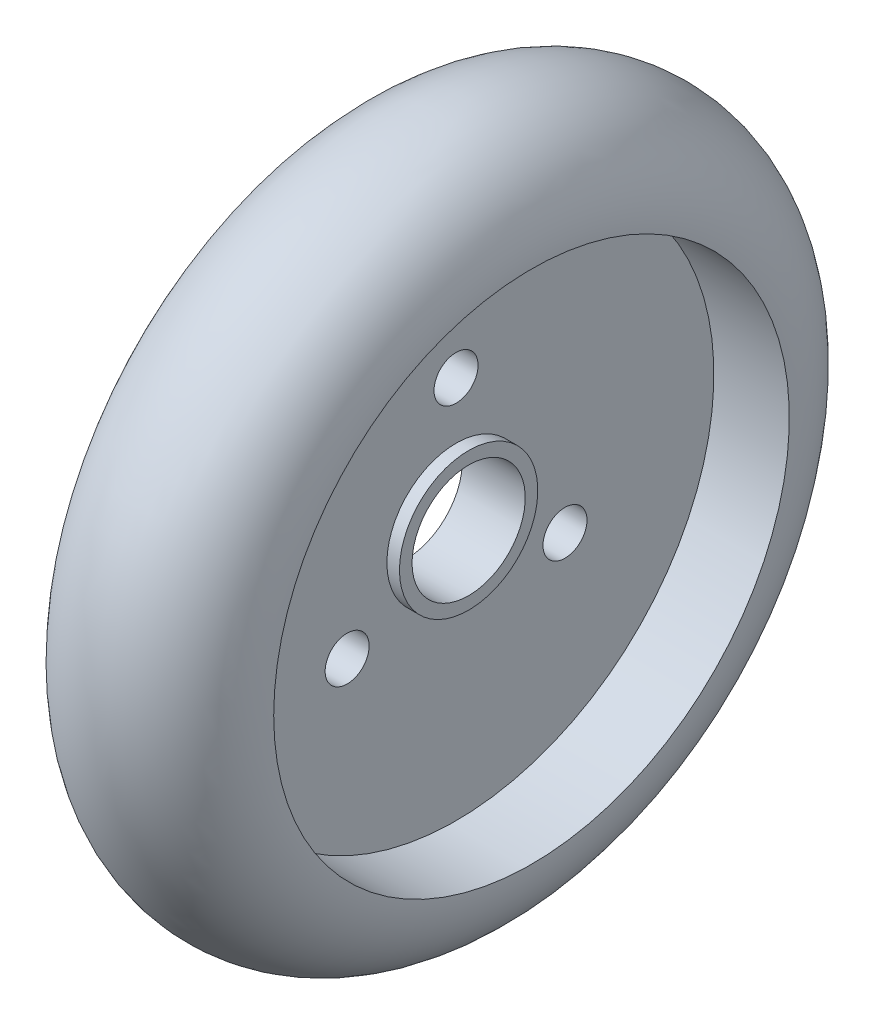
ISO-10303-21;
HEADER;
FILE_DESCRIPTION(('STEP AP214'),'2;1');
FILE_NAME('part.step','',(''),(''),'','','');
FILE_SCHEMA(('AUTOMOTIVE_DESIGN { 1 0 10303 214 1 1 1 1 }'));
ENDSEC;
DATA;
#1=APPLICATION_CONTEXT('core data for automotive mechanical design processes');
#2=APPLICATION_PROTOCOL_DEFINITION('international standard','automotive_design',2000,#1);
#3=PRODUCT_CONTEXT('',#1,'mechanical');
#4=PRODUCT('Part','Part','',(#3));
#5=PRODUCT_RELATED_PRODUCT_CATEGORY('part','',(#4));
#6=PRODUCT_DEFINITION_FORMATION('','',#4);
#7=PRODUCT_DEFINITION_CONTEXT('part definition',#1,'design');
#8=PRODUCT_DEFINITION('design','',#6,#7);
#9=PRODUCT_DEFINITION_SHAPE('','',#8);
#10=(LENGTH_UNIT() NAMED_UNIT(*) SI_UNIT(.MILLI.,.METRE.));
#11=(NAMED_UNIT(*) PLANE_ANGLE_UNIT() SI_UNIT($,.RADIAN.));
#12=(NAMED_UNIT(*) SI_UNIT($,.STERADIAN.) SOLID_ANGLE_UNIT());
#13=UNCERTAINTY_MEASURE_WITH_UNIT(LENGTH_MEASURE(1.E-05),#10,'distance_accuracy_value','');
#14=(GEOMETRIC_REPRESENTATION_CONTEXT(3) GLOBAL_UNCERTAINTY_ASSIGNED_CONTEXT((#13)) GLOBAL_UNIT_ASSIGNED_CONTEXT((#10,
#11,#12)) REPRESENTATION_CONTEXT('',''));
#15=CARTESIAN_POINT('',(0.,0.,0.));
#16=DIRECTION('',(0.,0.,1.));
#17=DIRECTION('',(1.,0.,0.));
#18=AXIS2_PLACEMENT_3D('',#15,#16,#17);
#19=CARTESIAN_POINT('',(2.5,4.5,0.));
#20=DIRECTION('',(-1.,0.,0.));
#21=DIRECTION('',(0.,0.,1.));
#22=AXIS2_PLACEMENT_3D('',#19,#20,#21);
#23=PLANE('',#22);
#24=CARTESIAN_POINT('',(2.5,0.,0.));
#25=DIRECTION('',(-1.,0.,0.));
#26=DIRECTION('',(0.,0.,1.));
#27=AXIS2_PLACEMENT_3D('',#24,#25,#26);
#28=CIRCLE('',#27,5.5);
#29=CARTESIAN_POINT('',(2.5,0.,5.5));
#30=VERTEX_POINT('',#29);
#31=EDGE_CURVE('E10',#30,#30,#28,.T.);
#32=ORIENTED_EDGE('',*,*,#31,.F.);
#33=EDGE_LOOP('',(#32));
#34=FACE_BOUND('',#33,.T.);
#35=CARTESIAN_POINT('',(2.5,0.,0.));
#36=DIRECTION('',(-1.,0.,0.));
#37=DIRECTION('',(0.,0.,1.));
#38=AXIS2_PLACEMENT_3D('',#35,#36,#37);
#39=CIRCLE('',#38,4.5);
#40=CARTESIAN_POINT('',(2.5,0.,4.5));
#41=VERTEX_POINT('',#40);
#42=EDGE_CURVE('E65',#41,#41,#39,.T.);
#43=ORIENTED_EDGE('',*,*,#42,.T.);
#44=EDGE_LOOP('',(#43));
#45=FACE_BOUND('',#44,.T.);
#46=ADVANCED_FACE('F31',(#34,#45),#23,.F.);
#47=CARTESIAN_POINT('',(0.,0.,0.));
#48=DIRECTION('',(-1.,0.,0.));
#49=DIRECTION('',(0.,0.,1.));
#50=AXIS2_PLACEMENT_3D('',#47,#48,#49);
#51=CYLINDRICAL_SURFACE('',#50,5.5);
#52=CARTESIAN_POINT('',(1.5,0.,0.));
#53=DIRECTION('',(-1.,0.,0.));
#54=DIRECTION('',(0.,0.,1.));
#55=AXIS2_PLACEMENT_3D('',#52,#53,#54);
#56=CIRCLE('',#55,5.5);
#57=CARTESIAN_POINT('',(1.5,0.,5.5));
#58=VERTEX_POINT('',#57);
#59=EDGE_CURVE('E38',#58,#58,#56,.T.);
#60=ORIENTED_EDGE('',*,*,#59,.F.);
#61=EDGE_LOOP('',(#60));
#62=FACE_BOUND('',#61,.T.);
#63=ORIENTED_EDGE('',*,*,#31,.T.);
#64=EDGE_LOOP('',(#63));
#65=FACE_BOUND('',#64,.T.);
#66=ADVANCED_FACE('F93',(#62,#65),#51,.T.);
#67=CARTESIAN_POINT('',(1.5,5.5,0.));
#68=DIRECTION('',(-1.,0.,0.));
#69=DIRECTION('',(0.,0.,1.));
#70=AXIS2_PLACEMENT_3D('',#67,#68,#69);
#71=PLANE('',#70);
#72=CARTESIAN_POINT('',(1.5,10.,0.));
#73=DIRECTION('',(-1.,0.,0.));
#74=DIRECTION('',(0.,0.,1.));
#75=AXIS2_PLACEMENT_3D('',#72,#73,#74);
#76=CIRCLE('',#75,1.75);
#77=CARTESIAN_POINT('',(1.5,10.,1.75));
#78=VERTEX_POINT('',#77);
#79=EDGE_CURVE('E62',#78,#78,#76,.T.);
#80=ORIENTED_EDGE('',*,*,#79,.T.);
#81=EDGE_LOOP('',(#80));
#82=FACE_BOUND('',#81,.T.);
#83=CARTESIAN_POINT('',(1.5,-5.,-8.66025403784438));
#84=DIRECTION('',(-1.,0.,0.));
#85=DIRECTION('',(0.,0.,1.));
#86=AXIS2_PLACEMENT_3D('',#83,#84,#85);
#87=CIRCLE('',#86,1.75);
#88=CARTESIAN_POINT('',(1.5,-5.,-6.91025403784438));
#89=VERTEX_POINT('',#88);
#90=EDGE_CURVE('E52',#89,#89,#87,.T.);
#91=ORIENTED_EDGE('',*,*,#90,.T.);
#92=EDGE_LOOP('',(#91));
#93=FACE_BOUND('',#92,.T.);
#94=CARTESIAN_POINT('',(1.5,-5.,8.66025403784439));
#95=DIRECTION('',(-1.,0.,0.));
#96=DIRECTION('',(0.,0.,1.));
#97=AXIS2_PLACEMENT_3D('',#94,#95,#96);
#98=CIRCLE('',#97,1.75);
#99=CARTESIAN_POINT('',(1.5,-5.,10.4102540378444));
#100=VERTEX_POINT('',#99);
#101=EDGE_CURVE('E49',#100,#100,#98,.T.);
#102=ORIENTED_EDGE('',*,*,#101,.T.);
#103=EDGE_LOOP('',(#102));
#104=FACE_BOUND('',#103,.T.);
#105=CARTESIAN_POINT('',(1.5,0.,0.));
#106=DIRECTION('',(-1.,0.,0.));
#107=DIRECTION('',(0.,0.,1.));
#108=AXIS2_PLACEMENT_3D('',#105,#106,#107);
#109=CIRCLE('',#108,20.5);
#110=CARTESIAN_POINT('',(1.5,0.,20.5));
#111=VERTEX_POINT('',#110);
#112=EDGE_CURVE('E43',#111,#111,#109,.T.);
#113=ORIENTED_EDGE('',*,*,#112,.F.);
#114=EDGE_LOOP('',(#113));
#115=FACE_BOUND('',#114,.T.);
#116=ORIENTED_EDGE('',*,*,#59,.T.);
#117=EDGE_LOOP('',(#116));
#118=FACE_BOUND('',#117,.T.);
#119=ADVANCED_FACE('F90',(#82,#93,#104,#115,#118),#71,.F.);
#120=CARTESIAN_POINT('',(0.,0.,0.));
#121=DIRECTION('',(-1.,0.,0.));
#122=DIRECTION('',(0.,0.,1.));
#123=AXIS2_PLACEMENT_3D('',#120,#121,#122);
#124=CYLINDRICAL_SURFACE('',#123,20.5);
#125=CARTESIAN_POINT('',(7.5,0.,0.));
#126=DIRECTION('',(-1.,0.,0.));
#127=DIRECTION('',(0.,0.,1.));
#128=AXIS2_PLACEMENT_3D('',#125,#126,#127);
#129=CIRCLE('',#128,20.5);
#130=CARTESIAN_POINT('',(7.5,0.,20.5));
#131=VERTEX_POINT('',#130);
#132=EDGE_CURVE('E83',#131,#131,#129,.T.);
#133=ORIENTED_EDGE('',*,*,#132,.F.);
#134=EDGE_LOOP('',(#133));
#135=FACE_BOUND('',#134,.T.);
#136=ORIENTED_EDGE('',*,*,#112,.T.);
#137=EDGE_LOOP('',(#136));
#138=FACE_BOUND('',#137,.T.);
#139=ADVANCED_FACE('F88',(#135,#138),#124,.F.);
#140=CARTESIAN_POINT('',(0.,0.,0.));
#141=DIRECTION('',(-1.,0.,0.));
#142=DIRECTION('',(0.,0.,1.));
#143=AXIS2_PLACEMENT_3D('',#140,#141,#142);
#144=TOROIDAL_SURFACE('',#143,20.5,7.5);
#145=CARTESIAN_POINT('',(-7.5,0.,0.));
#146=DIRECTION('',(-1.,0.,0.));
#147=DIRECTION('',(0.,0.,1.));
#148=AXIS2_PLACEMENT_3D('',#145,#146,#147);
#149=CIRCLE('',#148,20.5);
#150=CARTESIAN_POINT('',(-7.5,0.,20.5));
#151=VERTEX_POINT('',#150);
#152=EDGE_CURVE('E80',#151,#151,#149,.T.);
#153=ORIENTED_EDGE('',*,*,#152,.F.);
#154=EDGE_LOOP('',(#153));
#155=FACE_BOUND('',#154,.T.);
#156=ORIENTED_EDGE('',*,*,#132,.T.);
#157=EDGE_LOOP('',(#156));
#158=FACE_BOUND('',#157,.T.);
#159=ADVANCED_FACE('F106',(#155,#158),#144,.T.);
#160=CARTESIAN_POINT('',(0.,0.,0.));
#161=DIRECTION('',(-1.,0.,0.));
#162=DIRECTION('',(0.,0.,1.));
#163=AXIS2_PLACEMENT_3D('',#160,#161,#162);
#164=CYLINDRICAL_SURFACE('',#163,20.5);
#165=CARTESIAN_POINT('',(-1.5,0.,0.));
#166=DIRECTION('',(-1.,0.,0.));
#167=DIRECTION('',(0.,0.,1.));
#168=AXIS2_PLACEMENT_3D('',#165,#166,#167);
#169=CIRCLE('',#168,20.5);
#170=CARTESIAN_POINT('',(-1.5,0.,20.5));
#171=VERTEX_POINT('',#170);
#172=EDGE_CURVE('E77',#171,#171,#169,.T.);
#173=ORIENTED_EDGE('',*,*,#172,.F.);
#174=EDGE_LOOP('',(#173));
#175=FACE_BOUND('',#174,.T.);
#176=ORIENTED_EDGE('',*,*,#152,.T.);
#177=EDGE_LOOP('',(#176));
#178=FACE_BOUND('',#177,.T.);
#179=ADVANCED_FACE('F110',(#175,#178),#164,.F.);
#180=CARTESIAN_POINT('',(-1.5,5.5,0.));
#181=DIRECTION('',(1.,0.,0.));
#182=DIRECTION('',(0.,0.,-1.));
#183=AXIS2_PLACEMENT_3D('',#180,#181,#182);
#184=PLANE('',#183);
#185=CARTESIAN_POINT('',(-1.5,10.,0.));
#186=DIRECTION('',(1.,0.,0.));
#187=DIRECTION('',(0.,0.,-1.));
#188=AXIS2_PLACEMENT_3D('',#185,#186,#187);
#189=CIRCLE('',#188,1.75);
#190=CARTESIAN_POINT('',(-1.5,10.,-1.75));
#191=VERTEX_POINT('',#190);
#192=EDGE_CURVE('E34',#191,#191,#189,.T.);
#193=ORIENTED_EDGE('',*,*,#192,.T.);
#194=EDGE_LOOP('',(#193));
#195=FACE_BOUND('',#194,.T.);
#196=CARTESIAN_POINT('',(-1.5,-5.,-8.66025403784438));
#197=DIRECTION('',(1.,0.,0.));
#198=DIRECTION('',(0.,0.,-1.));
#199=AXIS2_PLACEMENT_3D('',#196,#197,#198);
#200=CIRCLE('',#199,1.75);
#201=CARTESIAN_POINT('',(-1.5,-5.,-10.4102540378444));
#202=VERTEX_POINT('',#201);
#203=EDGE_CURVE('E50',#202,#202,#200,.T.);
#204=ORIENTED_EDGE('',*,*,#203,.T.);
#205=EDGE_LOOP('',(#204));
#206=FACE_BOUND('',#205,.T.);
#207=CARTESIAN_POINT('',(-1.5,-5.,8.66025403784439));
#208=DIRECTION('',(1.,0.,0.));
#209=DIRECTION('',(0.,0.,-1.));
#210=AXIS2_PLACEMENT_3D('',#207,#208,#209);
#211=CIRCLE('',#210,1.75);
#212=CARTESIAN_POINT('',(-1.5,-5.,6.91025403784439));
#213=VERTEX_POINT('',#212);
#214=EDGE_CURVE('E47',#213,#213,#211,.T.);
#215=ORIENTED_EDGE('',*,*,#214,.T.);
#216=EDGE_LOOP('',(#215));
#217=FACE_BOUND('',#216,.T.);
#218=CARTESIAN_POINT('',(-1.5,0.,0.));
#219=DIRECTION('',(-1.,0.,0.));
#220=DIRECTION('',(0.,0.,1.));
#221=AXIS2_PLACEMENT_3D('',#218,#219,#220);
#222=CIRCLE('',#221,5.5);
#223=CARTESIAN_POINT('',(-1.5,0.,5.5));
#224=VERTEX_POINT('',#223);
#225=EDGE_CURVE('E74',#224,#224,#222,.T.);
#226=ORIENTED_EDGE('',*,*,#225,.F.);
#227=EDGE_LOOP('',(#226));
#228=FACE_BOUND('',#227,.T.);
#229=ORIENTED_EDGE('',*,*,#172,.T.);
#230=EDGE_LOOP('',(#229));
#231=FACE_BOUND('',#230,.T.);
#232=ADVANCED_FACE('F114',(#195,#206,#217,#228,#231),#184,.F.);
#233=CARTESIAN_POINT('',(0.,0.,0.));
#234=DIRECTION('',(-1.,0.,0.));
#235=DIRECTION('',(0.,0.,1.));
#236=AXIS2_PLACEMENT_3D('',#233,#234,#235);
#237=CYLINDRICAL_SURFACE('',#236,5.5);
#238=CARTESIAN_POINT('',(-2.5,0.,0.));
#239=DIRECTION('',(-1.,0.,0.));
#240=DIRECTION('',(0.,0.,1.));
#241=AXIS2_PLACEMENT_3D('',#238,#239,#240);
#242=CIRCLE('',#241,5.5);
#243=CARTESIAN_POINT('',(-2.5,0.,5.5));
#244=VERTEX_POINT('',#243);
#245=EDGE_CURVE('E71',#244,#244,#242,.T.);
#246=ORIENTED_EDGE('',*,*,#245,.F.);
#247=EDGE_LOOP('',(#246));
#248=FACE_BOUND('',#247,.T.);
#249=ORIENTED_EDGE('',*,*,#225,.T.);
#250=EDGE_LOOP('',(#249));
#251=FACE_BOUND('',#250,.T.);
#252=ADVANCED_FACE('F118',(#248,#251),#237,.T.);
#253=CARTESIAN_POINT('',(-2.5,4.5,0.));
#254=DIRECTION('',(1.,0.,0.));
#255=DIRECTION('',(0.,0.,-1.));
#256=AXIS2_PLACEMENT_3D('',#253,#254,#255);
#257=PLANE('',#256);
#258=CARTESIAN_POINT('',(-2.5,0.,0.));
#259=DIRECTION('',(-1.,0.,0.));
#260=DIRECTION('',(0.,0.,1.));
#261=AXIS2_PLACEMENT_3D('',#258,#259,#260);
#262=CIRCLE('',#261,4.5);
#263=CARTESIAN_POINT('',(-2.5,0.,4.5));
#264=VERTEX_POINT('',#263);
#265=EDGE_CURVE('E68',#264,#264,#262,.T.);
#266=ORIENTED_EDGE('',*,*,#265,.F.);
#267=EDGE_LOOP('',(#266));
#268=FACE_BOUND('',#267,.T.);
#269=ORIENTED_EDGE('',*,*,#245,.T.);
#270=EDGE_LOOP('',(#269));
#271=FACE_BOUND('',#270,.T.);
#272=ADVANCED_FACE('F122',(#268,#271),#257,.F.);
#273=CARTESIAN_POINT('',(0.,0.,0.));
#274=DIRECTION('',(-1.,0.,0.));
#275=DIRECTION('',(0.,0.,1.));
#276=AXIS2_PLACEMENT_3D('',#273,#274,#275);
#277=CYLINDRICAL_SURFACE('',#276,4.5);
#278=ORIENTED_EDGE('',*,*,#42,.F.);
#279=EDGE_LOOP('',(#278));
#280=FACE_BOUND('',#279,.T.);
#281=ORIENTED_EDGE('',*,*,#265,.T.);
#282=EDGE_LOOP('',(#281));
#283=FACE_BOUND('',#282,.T.);
#284=ADVANCED_FACE('F126',(#280,#283),#277,.F.);
#285=CARTESIAN_POINT('',(-7.5,-5.,8.66025403784439));
#286=DIRECTION('',(1.,0.,0.));
#287=DIRECTION('',(0.,0.,-1.));
#288=AXIS2_PLACEMENT_3D('',#285,#286,#287);
#289=CYLINDRICAL_SURFACE('',#288,1.75);
#290=ORIENTED_EDGE('',*,*,#214,.F.);
#291=EDGE_LOOP('',(#290));
#292=FACE_BOUND('',#291,.T.);
#293=ORIENTED_EDGE('',*,*,#101,.F.);
#294=EDGE_LOOP('',(#293));
#295=FACE_BOUND('',#294,.T.);
#296=ADVANCED_FACE('F130',(#292,#295),#289,.F.);
#297=CARTESIAN_POINT('',(-7.5,-5.,-8.66025403784438));
#298=DIRECTION('',(1.,0.,0.));
#299=DIRECTION('',(0.,0.,-1.));
#300=AXIS2_PLACEMENT_3D('',#297,#298,#299);
#301=CYLINDRICAL_SURFACE('',#300,1.75);
#302=ORIENTED_EDGE('',*,*,#203,.F.);
#303=EDGE_LOOP('',(#302));
#304=FACE_BOUND('',#303,.T.);
#305=ORIENTED_EDGE('',*,*,#90,.F.);
#306=EDGE_LOOP('',(#305));
#307=FACE_BOUND('',#306,.T.);
#308=ADVANCED_FACE('F134',(#304,#307),#301,.F.);
#309=CARTESIAN_POINT('',(-7.5,10.,0.));
#310=DIRECTION('',(1.,0.,0.));
#311=DIRECTION('',(0.,0.,-1.));
#312=AXIS2_PLACEMENT_3D('',#309,#310,#311);
#313=CYLINDRICAL_SURFACE('',#312,1.75);
#314=ORIENTED_EDGE('',*,*,#192,.F.);
#315=EDGE_LOOP('',(#314));
#316=FACE_BOUND('',#315,.T.);
#317=ORIENTED_EDGE('',*,*,#79,.F.);
#318=EDGE_LOOP('',(#317));
#319=FACE_BOUND('',#318,.T.);
#320=ADVANCED_FACE('F138',(#316,#319),#313,.F.);
#321=CLOSED_SHELL('',(#46,#66,#119,#139,#159,#179,#232,#252,#272,#284,#296,#308,#320));
#322=MANIFOLD_SOLID_BREP('B2',#321);
#323=ADVANCED_BREP_SHAPE_REPRESENTATION('',(#18,#322),#14);
#324=SHAPE_DEFINITION_REPRESENTATION(#9,#323);
ENDSEC;
END-ISO-10303-21;
